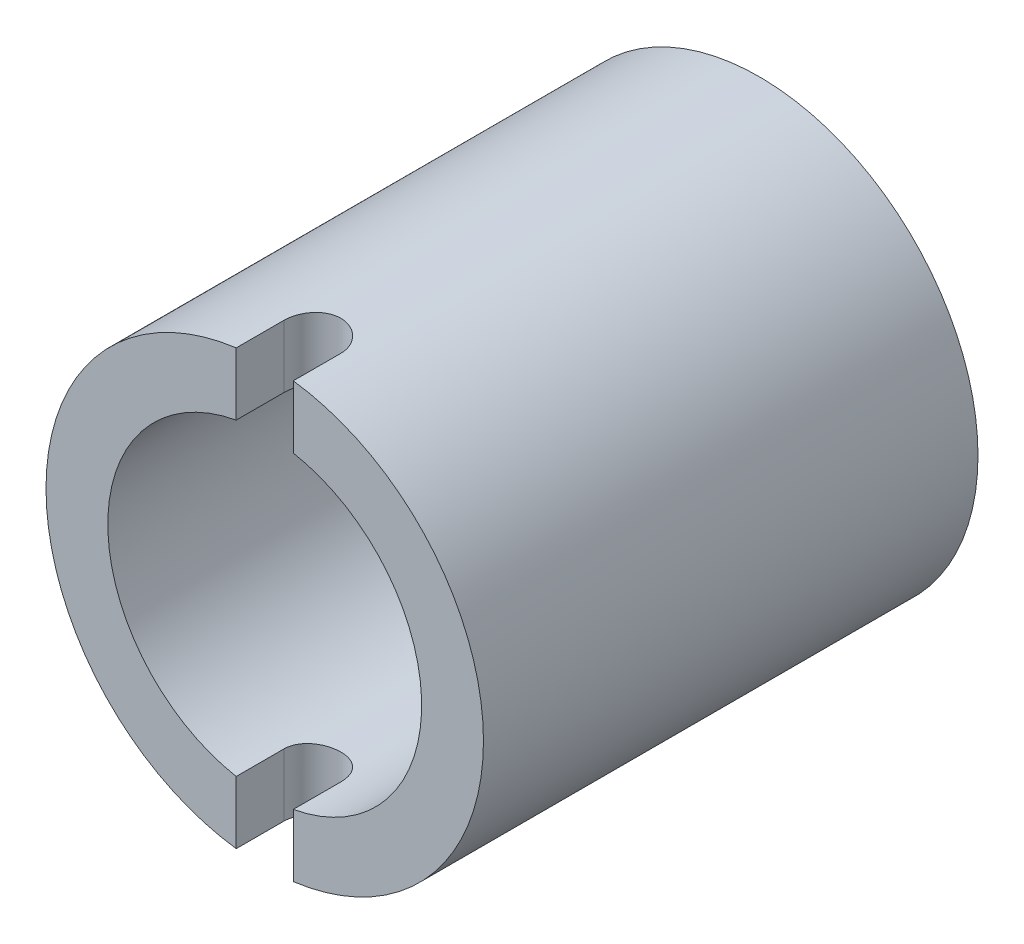
ISO-10303-21;
HEADER;
FILE_DESCRIPTION(('STEP AP214'),'2;1');
FILE_NAME('part.step','',(''),(''),'','','');
FILE_SCHEMA(('AUTOMOTIVE_DESIGN { 1 0 10303 214 1 1 1 1 }'));
ENDSEC;
DATA;
#1=APPLICATION_CONTEXT('core data for automotive mechanical design processes');
#2=APPLICATION_PROTOCOL_DEFINITION('international standard','automotive_design',2000,#1);
#3=PRODUCT_CONTEXT('',#1,'mechanical');
#4=PRODUCT('Part','Part','',(#3));
#5=PRODUCT_RELATED_PRODUCT_CATEGORY('part','',(#4));
#6=PRODUCT_DEFINITION_FORMATION('','',#4);
#7=PRODUCT_DEFINITION_CONTEXT('part definition',#1,'design');
#8=PRODUCT_DEFINITION('design','',#6,#7);
#9=PRODUCT_DEFINITION_SHAPE('','',#8);
#10=(LENGTH_UNIT() NAMED_UNIT(*) SI_UNIT(.MILLI.,.METRE.));
#11=(NAMED_UNIT(*) PLANE_ANGLE_UNIT() SI_UNIT($,.RADIAN.));
#12=(NAMED_UNIT(*) SI_UNIT($,.STERADIAN.) SOLID_ANGLE_UNIT());
#13=UNCERTAINTY_MEASURE_WITH_UNIT(LENGTH_MEASURE(1.E-05),#10,'distance_accuracy_value','');
#14=(GEOMETRIC_REPRESENTATION_CONTEXT(3) GLOBAL_UNCERTAINTY_ASSIGNED_CONTEXT((#13)) GLOBAL_UNIT_ASSIGNED_CONTEXT((#10,
#11,#12)) REPRESENTATION_CONTEXT('',''));
#15=CARTESIAN_POINT('',(0.,0.,0.));
#16=DIRECTION('',(0.,0.,1.));
#17=DIRECTION('',(1.,0.,0.));
#18=AXIS2_PLACEMENT_3D('',#15,#16,#17);
#19=CARTESIAN_POINT('',(0.,0.,20.6375));
#20=DIRECTION('',(0.,0.,1.));
#21=DIRECTION('',(1.,0.,0.));
#22=AXIS2_PLACEMENT_3D('',#19,#20,#21);
#23=PLANE('',#22);
#24=DIRECTION('',(0.,1.,0.));
#25=VECTOR('',#24,1.);
#26=CARTESIAN_POINT('',(-1.190625,-9.128125,20.6375));
#27=LINE('',#26,#25);
#28=CARTESIAN_POINT('',(-1.190625,6.43928923102397,20.6375));
#29=VERTEX_POINT('',#28);
#30=CARTESIAN_POINT('',(-1.190625,9.05014243672441,20.6375));
#31=VERTEX_POINT('',#30);
#32=EDGE_CURVE('E187',#29,#31,#27,.T.);
#33=ORIENTED_EDGE('',*,*,#32,.T.);
#34=CARTESIAN_POINT('',(0.,0.,20.6375));
#35=DIRECTION('',(0.,0.,1.));
#36=DIRECTION('',(1.,0.,0.));
#37=AXIS2_PLACEMENT_3D('',#34,#35,#36);
#38=CIRCLE('',#37,9.128125);
#39=CARTESIAN_POINT('',(-1.190625,-9.05014243672441,20.6375));
#40=VERTEX_POINT('',#39);
#41=EDGE_CURVE('E189',#31,#40,#38,.T.);
#42=ORIENTED_EDGE('',*,*,#41,.T.);
#43=CARTESIAN_POINT('',(-1.190625,-6.43928923102397,20.6375));
#44=VERTEX_POINT('',#43);
#45=EDGE_CURVE('E124',#40,#44,#27,.T.);
#46=ORIENTED_EDGE('',*,*,#45,.T.);
#47=CARTESIAN_POINT('',(0.,0.,20.6375));
#48=DIRECTION('',(0.,0.,1.));
#49=DIRECTION('',(1.,0.,0.));
#50=AXIS2_PLACEMENT_3D('',#47,#48,#49);
#51=CIRCLE('',#50,6.5484375);
#52=EDGE_CURVE('E191',#29,#44,#51,.T.);
#53=ORIENTED_EDGE('',*,*,#52,.F.);
#54=EDGE_LOOP('',(#33,#42,#46,#53));
#55=FACE_BOUND('',#54,.T.);
#56=ADVANCED_FACE('F32',(#55),#23,.T.);
#57=DIRECTION('',(0.,1.,0.));
#58=VECTOR('',#57,1.);
#59=CARTESIAN_POINT('',(1.190625,-9.128125,20.6375));
#60=LINE('',#59,#58);
#61=CARTESIAN_POINT('',(1.190625,-9.0501424367244,20.6375));
#62=VERTEX_POINT('',#61);
#63=CARTESIAN_POINT('',(1.190625,-6.43928923102397,20.6375));
#64=VERTEX_POINT('',#63);
#65=EDGE_CURVE('E56',#62,#64,#60,.T.);
#66=ORIENTED_EDGE('',*,*,#65,.F.);
#67=CARTESIAN_POINT('',(1.190625,9.0501424367244,20.6375));
#68=VERTEX_POINT('',#67);
#69=EDGE_CURVE('E121',#62,#68,#38,.T.);
#70=ORIENTED_EDGE('',*,*,#69,.T.);
#71=CARTESIAN_POINT('',(1.190625,6.43928923102397,20.6375));
#72=VERTEX_POINT('',#71);
#73=EDGE_CURVE('E213',#72,#68,#60,.T.);
#74=ORIENTED_EDGE('',*,*,#73,.F.);
#75=EDGE_CURVE('E206',#64,#72,#51,.T.);
#76=ORIENTED_EDGE('',*,*,#75,.F.);
#77=EDGE_LOOP('',(#66,#70,#74,#76));
#78=FACE_BOUND('',#77,.T.);
#79=ADVANCED_FACE('F168',(#78),#23,.T.);
#80=CARTESIAN_POINT('',(0.,0.,0.));
#81=DIRECTION('',(0.,0.,1.));
#82=DIRECTION('',(1.,0.,0.));
#83=AXIS2_PLACEMENT_3D('',#80,#81,#82);
#84=PLANE('',#83);
#85=CARTESIAN_POINT('',(0.,0.,0.));
#86=DIRECTION('',(0.,0.,1.));
#87=DIRECTION('',(1.,0.,0.));
#88=AXIS2_PLACEMENT_3D('',#85,#86,#87);
#89=CIRCLE('',#88,9.128125);
#90=CARTESIAN_POINT('',(9.128125,0.,0.));
#91=VERTEX_POINT('',#90);
#92=EDGE_CURVE('E200',#91,#91,#89,.T.);
#93=ORIENTED_EDGE('',*,*,#92,.F.);
#94=EDGE_LOOP('',(#93));
#95=FACE_BOUND('',#94,.T.);
#96=CARTESIAN_POINT('',(0.,0.,0.));
#97=DIRECTION('',(0.,0.,1.));
#98=DIRECTION('',(1.,0.,0.));
#99=AXIS2_PLACEMENT_3D('',#96,#97,#98);
#100=CIRCLE('',#99,6.5484375);
#101=CARTESIAN_POINT('',(6.5484375,0.,0.));
#102=VERTEX_POINT('',#101);
#103=EDGE_CURVE('E203',#102,#102,#100,.T.);
#104=ORIENTED_EDGE('',*,*,#103,.T.);
#105=EDGE_LOOP('',(#104));
#106=FACE_BOUND('',#105,.T.);
#107=ADVANCED_FACE('F171',(#95,#106),#84,.F.);
#108=CARTESIAN_POINT('',(0.,0.,20.6375));
#109=DIRECTION('',(0.,0.,-1.));
#110=DIRECTION('',(-1.,0.,0.));
#111=AXIS2_PLACEMENT_3D('',#108,#109,#110);
#112=CYLINDRICAL_SURFACE('',#111,9.128125);
#113=ORIENTED_EDGE('',*,*,#41,.F.);
#114=DIRECTION('',(0.,0.,-1.));
#115=VECTOR('',#114,1.);
#116=CARTESIAN_POINT('',(-1.190625,9.05014243672441,20.6375));
#117=LINE('',#116,#115);
#118=CARTESIAN_POINT('',(-1.190625,9.05014243672441,18.653125));
#119=VERTEX_POINT('',#118);
#120=EDGE_CURVE('E196',#31,#119,#117,.T.);
#121=ORIENTED_EDGE('',*,*,#120,.T.);
#122=CARTESIAN_POINT('',(-1.190625,9.05014243672441,18.653125));
#123=CARTESIAN_POINT('',(-1.190624947356,9.05014137139708,18.6197795693083));
#124=CARTESIAN_POINT('',(-1.18922327600845,9.05032696444553,18.5864502538779));
#125=CARTESIAN_POINT('',(-1.18363255161982,9.05106025548984,18.5200329229892));
#126=CARTESIAN_POINT('',(-1.17944372053075,9.0516079246522,18.4869448885288));
#127=CARTESIAN_POINT('',(-1.16274159058484,9.05377446731096,18.3884759726554));
#128=CARTESIAN_POINT('',(-1.14609251160274,9.05591696148237,18.3237591268127));
#129=CARTESIAN_POINT('',(-1.10224843785137,9.06135731015229,18.1980709970631));
#130=CARTESIAN_POINT('',(-1.07505012176614,9.06465552848673,18.1371008997908));
#131=CARTESIAN_POINT('',(-1.01089108580039,9.07203417337444,18.0205844126923));
#132=CARTESIAN_POINT('',(-0.973931025697229,9.07611454705824,17.9650376566603));
#133=CARTESIAN_POINT('',(-0.89106310246201,9.0846250016956,17.8606217180314));
#134=CARTESIAN_POINT('',(-0.845108557834061,9.08905683209112,17.8117897386654));
#135=CARTESIAN_POINT('',(-0.745650838027167,9.09775565953449,17.7225019923537));
#136=CARTESIAN_POINT('',(-0.692146513891997,9.10202263136735,17.6820475026451));
#137=CARTESIAN_POINT('',(-0.578873843864539,9.10992870060639,17.61053448392));
#138=CARTESIAN_POINT('',(-0.5190837217859,9.11356549142321,17.5795101714068));
#139=CARTESIAN_POINT('',(-0.395090060618663,9.11978171528337,17.5279588349093));
#140=CARTESIAN_POINT('',(-0.330886959898611,9.12236125317347,17.5074307699722));
#141=CARTESIAN_POINT('',(-0.200273515315098,9.12616013279416,17.4775652030612));
#142=CARTESIAN_POINT('',(-0.133877778960786,9.1273871167736,17.4681648046237));
#143=CARTESIAN_POINT('',(-0.000439021817143565,9.12836877170156,17.4606263504033));
#144=CARTESIAN_POINT('',(0.0666039869880744,9.12812346985715,17.462488086502));
#145=CARTESIAN_POINT('',(0.199002437858018,9.12619430511551,17.4773712123961));
#146=CARTESIAN_POINT('',(0.264365665281769,9.12451920317901,17.490324640464));
#147=CARTESIAN_POINT('',(0.391982238971198,9.1199284862309,17.5269170609291));
#148=CARTESIAN_POINT('',(0.454235538957172,9.11701285276474,17.5505562122909));
#149=CARTESIAN_POINT('',(0.574076057119672,9.11025351876185,17.6079212524633));
#150=CARTESIAN_POINT('',(0.631649024051992,9.10640711583797,17.6416765818153));
#151=CARTESIAN_POINT('',(0.740336424381162,9.09821647254577,17.7182929934277));
#152=CARTESIAN_POINT('',(0.791450804378284,9.09387222806186,17.7611541509674));
#153=CARTESIAN_POINT('',(0.886165866514196,9.08513397579924,17.8551390132363));
#154=CARTESIAN_POINT('',(0.929708850347609,9.08073983646005,17.9063208655067));
#155=CARTESIAN_POINT('',(1.00760835898456,9.07242699735334,18.0153159782176));
#156=CARTESIAN_POINT('',(1.04196216777659,9.06850843833791,18.0731311920579));
#157=CARTESIAN_POINT('',(1.10051180372984,9.06158999914031,18.1938128588677));
#158=CARTESIAN_POINT('',(1.12469670995349,9.0585911075694,18.2566846565219));
#159=CARTESIAN_POINT('',(1.16211358774377,9.053867664554,18.38559978733));
#160=CARTESIAN_POINT('',(1.17536203705676,9.05214119639624,18.4516381899777));
#161=CARTESIAN_POINT('',(1.18551629052944,9.05081321998308,18.5406499440119));
#162=CARTESIAN_POINT('',(1.18743295408717,9.05056186000145,18.5631214482745));
#163=CARTESIAN_POINT('',(1.18998559990429,9.05022666112611,18.6081004504055));
#164=CARTESIAN_POINT('',(1.19062373007838,9.0501425412736,18.6306078242253));
#165=CARTESIAN_POINT('',(1.190625,9.05014243672441,18.653125));
#166=B_SPLINE_CURVE_WITH_KNOTS('',3,(#122,#123,#124,#125,#126,#127,#128,#129,#130,#131,#132,
#133,#134,#135,#136,#137,#138,#139,#140,#141,#142,#143,#144,#145,#146,#147,#148,#149,#150,#151,
#152,#153,#154,#155,#156,#157,#158,#159,#160,#161,#162,#163,#164,#165),.UNSPECIFIED.,.F.,.F.,(4,
2,2,2,2,2,2,2,2,2,2,2,2,2,2,2,2,2,2,2,2,4),(0.,0.0999743982543603,0.199940836123429,
0.39948529758251,0.599092634572429,0.798686483940046,0.99934509490912,1.20003427592435,
1.40144317740754,1.60283210052921,1.80307720163999,2.00331860233798,2.20234177944123,
2.40136791738255,2.60097898931192,2.80059171152173,3.00166461323022,3.20279687983,
3.40414460496963,3.60518840684066,3.67282487868008,3.74034762678012),.UNSPECIFIED.);
#167=CARTESIAN_POINT('',(1.190625,9.0501424367244,18.653125));
#168=VERTEX_POINT('',#167);
#169=EDGE_CURVE('E109',#119,#168,#166,.T.);
#170=ORIENTED_EDGE('',*,*,#169,.T.);
#171=DIRECTION('',(0.,0.,-1.));
#172=VECTOR('',#171,1.);
#173=CARTESIAN_POINT('',(1.190625,9.0501424367244,20.6375));
#174=LINE('',#173,#172);
#175=EDGE_CURVE('E122',#168,#68,#174,.F.);
#176=ORIENTED_EDGE('',*,*,#175,.T.);
#177=ORIENTED_EDGE('',*,*,#69,.F.);
#178=DIRECTION('',(0.,0.,-1.));
#179=VECTOR('',#178,1.);
#180=CARTESIAN_POINT('',(1.190625,-9.0501424367244,20.6375));
#181=LINE('',#180,#179);
#182=CARTESIAN_POINT('',(1.190625,-9.0501424367244,18.653125));
#183=VERTEX_POINT('',#182);
#184=EDGE_CURVE('E110',#62,#183,#181,.T.);
#185=ORIENTED_EDGE('',*,*,#184,.T.);
#186=CARTESIAN_POINT('',(1.190625,-9.0501424367244,18.653125));
#187=CARTESIAN_POINT('',(1.190624947356,-9.05014137139708,18.6197795693083));
#188=CARTESIAN_POINT('',(1.18922327600846,-9.05032696444553,18.5864502538779));
#189=CARTESIAN_POINT('',(1.18363255161982,-9.05106025548984,18.5200329229892));
#190=CARTESIAN_POINT('',(1.17944372053075,-9.0516079246522,18.4869448885288));
#191=CARTESIAN_POINT('',(1.16274159058484,-9.05377446731095,18.3884759726554));
#192=CARTESIAN_POINT('',(1.14609251160274,-9.05591696148237,18.3237591268127));
#193=CARTESIAN_POINT('',(1.10224843785138,-9.06135731015229,18.1980709970631));
#194=CARTESIAN_POINT('',(1.07505012176615,-9.06465552848673,18.1371008997908));
#195=CARTESIAN_POINT('',(1.01089108580039,-9.07203417337444,18.0205844126923));
#196=CARTESIAN_POINT('',(0.973931025697232,-9.07611454705824,17.9650376566603));
#197=CARTESIAN_POINT('',(0.891063102462014,-9.0846250016956,17.8606217180314));
#198=CARTESIAN_POINT('',(0.845108557834065,-9.08905683209112,17.8117897386654));
#199=CARTESIAN_POINT('',(0.745650838027171,-9.09775565953449,17.7225019923537));
#200=CARTESIAN_POINT('',(0.692146513892001,-9.10202263136735,17.6820475026451));
#201=CARTESIAN_POINT('',(0.578873843864542,-9.10992870060639,17.61053448392));
#202=CARTESIAN_POINT('',(0.519083721785904,-9.11356549142321,17.5795101714068));
#203=CARTESIAN_POINT('',(0.395090060618666,-9.11978171528337,17.5279588349093));
#204=CARTESIAN_POINT('',(0.330886959898614,-9.12236125317347,17.5074307699722));
#205=CARTESIAN_POINT('',(0.200273515315101,-9.12616013279416,17.4775652030612));
#206=CARTESIAN_POINT('',(0.133877778960789,-9.1273871167736,17.4681648046237));
#207=CARTESIAN_POINT('',(0.000439021817146993,-9.12836877170156,17.4606263504033));
#208=CARTESIAN_POINT('',(-0.066603986988071,-9.12812346985715,17.462488086502));
#209=CARTESIAN_POINT('',(-0.199002437858015,-9.12619430511551,17.4773712123961));
#210=CARTESIAN_POINT('',(-0.264365665281766,-9.12451920317901,17.490324640464));
#211=CARTESIAN_POINT('',(-0.391982238971195,-9.1199284862309,17.5269170609291));
#212=CARTESIAN_POINT('',(-0.454235538957169,-9.11701285276474,17.5505562122909));
#213=CARTESIAN_POINT('',(-0.574076057119668,-9.11025351876185,17.6079212524633));
#214=CARTESIAN_POINT('',(-0.631649024051988,-9.10640711583797,17.6416765818153));
#215=CARTESIAN_POINT('',(-0.740336424381158,-9.09821647254577,17.7182929934277));
#216=CARTESIAN_POINT('',(-0.791450804378281,-9.09387222806186,17.7611541509673));
#217=CARTESIAN_POINT('',(-0.886165866514194,-9.08513397579924,17.8551390132363));
#218=CARTESIAN_POINT('',(-0.929708850347606,-9.08073983646006,17.9063208655067));
#219=CARTESIAN_POINT('',(-1.00760835898456,-9.07242699735334,18.0153159782176));
#220=CARTESIAN_POINT('',(-1.04196216777658,-9.06850843833792,18.0731311920579));
#221=CARTESIAN_POINT('',(-1.10051180372984,-9.06158999914031,18.1938128588677));
#222=CARTESIAN_POINT('',(-1.12469670995349,-9.0585911075694,18.2566846565219));
#223=CARTESIAN_POINT('',(-1.16211358774376,-9.053867664554,18.38559978733));
#224=CARTESIAN_POINT('',(-1.17536203705675,-9.05214119639624,18.4516381899777));
#225=CARTESIAN_POINT('',(-1.18551629052944,-9.05081321998308,18.5406499440119));
#226=CARTESIAN_POINT('',(-1.18743295408717,-9.05056186000145,18.5631214482745));
#227=CARTESIAN_POINT('',(-1.18998559990429,-9.05022666112611,18.6081004504055));
#228=CARTESIAN_POINT('',(-1.19062373007838,-9.0501425412736,18.6306078242253));
#229=CARTESIAN_POINT('',(-1.190625,-9.05014243672441,18.653125));
#230=B_SPLINE_CURVE_WITH_KNOTS('',3,(#186,#187,#188,#189,#190,#191,#192,#193,#194,#195,#196,
#197,#198,#199,#200,#201,#202,#203,#204,#205,#206,#207,#208,#209,#210,#211,#212,#213,#214,#215,
#216,#217,#218,#219,#220,#221,#222,#223,#224,#225,#226,#227,#228,#229),.UNSPECIFIED.,.F.,.F.,(4,
2,2,2,2,2,2,2,2,2,2,2,2,2,2,2,2,2,2,2,2,4),(0.,0.0999743982543638,0.199940836123429,
0.39948529758251,0.599092634572429,0.798686483940046,0.99934509490912,1.20003427592435,
1.40144317740754,1.60283210052921,1.80307720163999,2.00331860233798,2.20234177944123,
2.40136791738255,2.60097898931192,2.80059171152173,3.00166461323022,3.20279687983,
3.40414460496964,3.60518840684066,3.67282487868008,3.74034762678012),.UNSPECIFIED.);
#231=CARTESIAN_POINT('',(-1.190625,-9.05014243672441,18.653125));
#232=VERTEX_POINT('',#231);
#233=EDGE_CURVE('E98',#183,#232,#230,.T.);
#234=ORIENTED_EDGE('',*,*,#233,.T.);
#235=DIRECTION('',(0.,0.,-1.));
#236=VECTOR('',#235,1.);
#237=CARTESIAN_POINT('',(-1.190625,-9.05014243672441,20.6375));
#238=LINE('',#237,#236);
#239=EDGE_CURVE('E197',#232,#40,#238,.F.);
#240=ORIENTED_EDGE('',*,*,#239,.T.);
#241=EDGE_LOOP('',(#113,#121,#170,#176,#177,#185,#234,#240));
#242=FACE_BOUND('',#241,.T.);
#243=ORIENTED_EDGE('',*,*,#92,.T.);
#244=EDGE_LOOP('',(#243));
#245=FACE_BOUND('',#244,.T.);
#246=ADVANCED_FACE('F34',(#242,#245),#112,.T.);
#247=CARTESIAN_POINT('',(0.,0.,20.6375));
#248=DIRECTION('',(0.,0.,-1.));
#249=DIRECTION('',(-1.,0.,0.));
#250=AXIS2_PLACEMENT_3D('',#247,#248,#249);
#251=CYLINDRICAL_SURFACE('',#250,6.5484375);
#252=DIRECTION('',(0.,0.,-1.));
#253=VECTOR('',#252,1.);
#254=CARTESIAN_POINT('',(-1.190625,-6.43928923102397,20.6375));
#255=LINE('',#254,#253);
#256=CARTESIAN_POINT('',(-1.190625,-6.43928923102397,18.653125));
#257=VERTEX_POINT('',#256);
#258=EDGE_CURVE('E11',#257,#44,#255,.F.);
#259=ORIENTED_EDGE('',*,*,#258,.F.);
#260=CARTESIAN_POINT('',(1.190625,-6.43928923102397,18.653125));
#261=CARTESIAN_POINT('',(1.19062510752317,-6.43928770257222,18.6199232680346));
#262=CARTESIAN_POINT('',(1.18923532743987,-6.43954634610227,18.5867377190781));
#263=CARTESIAN_POINT('',(1.18369309264754,-6.44056799660428,18.5206096026158));
#264=CARTESIAN_POINT('',(1.17954094250811,-6.44133094797289,18.4876670087275));
#265=CARTESIAN_POINT('',(1.16299117592537,-6.44434781901215,18.3896568905554));
#266=CARTESIAN_POINT('',(1.146500061898,-6.44732989835494,18.3252546020243));
#267=CARTESIAN_POINT('',(1.10309941994908,-6.45489614735933,18.2001921345008));
#268=CARTESIAN_POINT('',(1.07618809386641,-6.45948059351965,18.1395326034722));
#269=CARTESIAN_POINT('',(1.01272961067242,-6.46973274639033,18.0235750668221));
#270=CARTESIAN_POINT('',(0.976181949820444,-6.47540050972698,17.9682773416965));
#271=CARTESIAN_POINT('',(0.894039305428961,-6.48725382113382,17.8639901260232));
#272=CARTESIAN_POINT('',(0.848354405820006,-6.49344413037186,17.8150720213982));
#273=CARTESIAN_POINT('',(0.749423124613033,-6.50560359349911,17.7255453651157));
#274=CARTESIAN_POINT('',(0.696175581294696,-6.51157271323277,17.6849380924536));
#275=CARTESIAN_POINT('',(0.583162615140336,-6.52266791042578,17.6129181314072));
#276=CARTESIAN_POINT('',(0.523353423398692,-6.52778767299984,17.5815730704674));
#277=CARTESIAN_POINT('',(0.399212828448163,-6.53655334671288,17.5294040367622));
#278=CARTESIAN_POINT('',(0.334882028249734,-6.54019945394524,17.508578664092));
#279=CARTESIAN_POINT('',(0.204267272389198,-6.54557348284042,17.4782597430652));
#280=CARTESIAN_POINT('',(0.138012341535047,-6.54732193006298,17.468644853142));
#281=CARTESIAN_POINT('',(0.00480662729172874,-6.54877433974144,17.4606418941512));
#282=CARTESIAN_POINT('',(-0.0621441163690738,-6.54847841828993,17.4622531875879));
#283=CARTESIAN_POINT('',(-0.194006135992889,-6.5458914545404,17.4765637696531));
#284=CARTESIAN_POINT('',(-0.258932149810519,-6.54362397132675,17.4891321319866));
#285=CARTESIAN_POINT('',(-0.385737614345413,-6.53737506014642,17.524793183831));
#286=CARTESIAN_POINT('',(-0.44761697961102,-6.53339358413657,17.5478861683479));
#287=CARTESIAN_POINT('',(-0.566956566448118,-6.52412438172898,17.6040676099579));
#288=CARTESIAN_POINT('',(-0.624391297389477,-6.51882976168969,17.6372090296749));
#289=CARTESIAN_POINT('',(-0.732931284088821,-6.50752084691352,17.7125065411896));
#290=CARTESIAN_POINT('',(-0.784036154546667,-6.50150650841096,17.7546631813205));
#291=CARTESIAN_POINT('',(-0.879237054342009,-6.48932324144752,17.8475109148418));
#292=CARTESIAN_POINT('',(-0.92322234692524,-6.48315333234577,17.8983154821172));
#293=CARTESIAN_POINT('',(-1.0020758608004,-6.47143510496664,18.0066571101458));
#294=CARTESIAN_POINT('',(-1.03694151929509,-6.46588696166755,18.0641960568312));
#295=CARTESIAN_POINT('',(-1.09659542119064,-6.45603839444269,18.1845229898495));
#296=CARTESIAN_POINT('',(-1.12136250757994,-6.45174059538897,18.2473216673713));
#297=CARTESIAN_POINT('',(-1.15992908896552,-6.44491956903265,18.376242277518));
#298=CARTESIAN_POINT('',(-1.17374494838579,-6.4423936945942,18.4423590940327));
#299=CARTESIAN_POINT('',(-1.18479720692756,-6.44036442329278,18.5330125719995));
#300=CARTESIAN_POINT('',(-1.18698347732095,-6.43996162130896,18.5570023631168));
#301=CARTESIAN_POINT('',(-1.18989550083011,-6.43942427625262,18.6050328913964));
#302=CARTESIAN_POINT('',(-1.19062370760708,-6.43928928251008,18.6290734747022));
#303=CARTESIAN_POINT('',(-1.190625,-6.43928923102397,18.653125));
#304=B_SPLINE_CURVE_WITH_KNOTS('',3,(#260,#261,#262,#263,#264,#265,#266,#267,#268,#269,#270,
#271,#272,#273,#274,#275,#276,#277,#278,#279,#280,#281,#282,#283,#284,#285,#286,#287,#288,#289,
#290,#291,#292,#293,#294,#295,#296,#297,#298,#299,#300,#301,#302,#303),.UNSPECIFIED.,.F.,.F.,(4,
2,2,2,2,2,2,2,2,2,2,2,2,2,2,2,2,2,2,2,2,4),(0.,0.0995431293226911,0.199075285174556,
0.397688211180561,0.596335426058866,0.794993027305768,0.995711320331554,1.19646047970973,
1.39864109789127,1.60079480384762,1.80073947853485,2.00067279915423,2.19824935776925,
2.39583145481025,2.59447361231762,2.79312785528518,2.99462425847635,3.19617722544658,
3.39815031269194,3.59982101947267,3.67206403974184,3.74418538536144),.UNSPECIFIED.);
#305=CARTESIAN_POINT('',(1.190625,-6.43928923102397,18.653125));
#306=VERTEX_POINT('',#305);
#307=EDGE_CURVE('E41',#306,#257,#304,.T.);
#308=ORIENTED_EDGE('',*,*,#307,.F.);
#309=DIRECTION('',(0.,0.,-1.));
#310=VECTOR('',#309,1.);
#311=CARTESIAN_POINT('',(1.190625,-6.43928923102397,20.6375));
#312=LINE('',#311,#310);
#313=EDGE_CURVE('E113',#64,#306,#312,.T.);
#314=ORIENTED_EDGE('',*,*,#313,.F.);
#315=ORIENTED_EDGE('',*,*,#75,.T.);
#316=DIRECTION('',(0.,0.,-1.));
#317=VECTOR('',#316,1.);
#318=CARTESIAN_POINT('',(1.190625,6.43928923102397,20.6375));
#319=LINE('',#318,#317);
#320=CARTESIAN_POINT('',(1.190625,6.43928923102397,18.653125));
#321=VERTEX_POINT('',#320);
#322=EDGE_CURVE('E198',#321,#72,#319,.F.);
#323=ORIENTED_EDGE('',*,*,#322,.F.);
#324=CARTESIAN_POINT('',(-1.190625,6.43928923102397,18.653125));
#325=CARTESIAN_POINT('',(-1.19062510752316,6.43928770257222,18.6199232680346));
#326=CARTESIAN_POINT('',(-1.18923532743986,6.43954634610227,18.5867377190781));
#327=CARTESIAN_POINT('',(-1.18369309264754,6.44056799660428,18.5206096026158));
#328=CARTESIAN_POINT('',(-1.17954094250811,6.44133094797289,18.4876670087275));
#329=CARTESIAN_POINT('',(-1.16299117592536,6.44434781901215,18.3896568905554));
#330=CARTESIAN_POINT('',(-1.146500061898,6.44732989835494,18.3252546020243));
#331=CARTESIAN_POINT('',(-1.10309941994908,6.45489614735933,18.2001921345008));
#332=CARTESIAN_POINT('',(-1.07618809386641,6.45948059351965,18.1395326034722));
#333=CARTESIAN_POINT('',(-1.01272961067242,6.46973274639033,18.0235750668221));
#334=CARTESIAN_POINT('',(-0.976181949820441,6.47540050972698,17.9682773416965));
#335=CARTESIAN_POINT('',(-0.894039305428957,6.48725382113382,17.8639901260232));
#336=CARTESIAN_POINT('',(-0.848354405820003,6.49344413037186,17.8150720213982));
#337=CARTESIAN_POINT('',(-0.749423124613029,6.50560359349911,17.7255453651157));
#338=CARTESIAN_POINT('',(-0.696175581294693,6.51157271323277,17.6849380924536));
#339=CARTESIAN_POINT('',(-0.583162615140332,6.52266791042578,17.6129181314072));
#340=CARTESIAN_POINT('',(-0.523353423398689,6.52778767299984,17.5815730704674));
#341=CARTESIAN_POINT('',(-0.39921282844816,6.53655334671288,17.5294040367622));
#342=CARTESIAN_POINT('',(-0.33488202824973,6.54019945394524,17.508578664092));
#343=CARTESIAN_POINT('',(-0.204267272389195,6.54557348284042,17.4782597430652));
#344=CARTESIAN_POINT('',(-0.138012341535044,6.54732193006298,17.468644853142));
#345=CARTESIAN_POINT('',(-0.00480662729172546,6.54877433974144,17.4606418941512));
#346=CARTESIAN_POINT('',(0.0621441163690771,6.54847841828993,17.4622531875879));
#347=CARTESIAN_POINT('',(0.194006135992892,6.5458914545404,17.4765637696531));
#348=CARTESIAN_POINT('',(0.258932149810522,6.54362397132675,17.4891321319866));
#349=CARTESIAN_POINT('',(0.385737614345415,6.53737506014642,17.524793183831));
#350=CARTESIAN_POINT('',(0.447616979611023,6.53339358413657,17.5478861683479));
#351=CARTESIAN_POINT('',(0.566956566448122,6.52412438172898,17.6040676099579));
#352=CARTESIAN_POINT('',(0.62439129738948,6.51882976168969,17.6372090296749));
#353=CARTESIAN_POINT('',(0.732931284088825,6.50752084691352,17.7125065411896));
#354=CARTESIAN_POINT('',(0.784036154546671,6.50150650841096,17.7546631813205));
#355=CARTESIAN_POINT('',(0.879237054342012,6.48932324144752,17.8475109148418));
#356=CARTESIAN_POINT('',(0.923222346925243,6.48315333234577,17.8983154821172));
#357=CARTESIAN_POINT('',(1.00207586080041,6.47143510496664,18.0066571101458));
#358=CARTESIAN_POINT('',(1.0369415192951,6.46588696166755,18.0641960568312));
#359=CARTESIAN_POINT('',(1.09659542119064,6.45603839444269,18.1845229898495));
#360=CARTESIAN_POINT('',(1.12136250757994,6.45174059538897,18.2473216673713));
#361=CARTESIAN_POINT('',(1.15992908896553,6.44491956903265,18.376242277518));
#362=CARTESIAN_POINT('',(1.17374494838579,6.4423936945942,18.4423590940327));
#363=CARTESIAN_POINT('',(1.18479720692757,6.44036442329278,18.5330125719995));
#364=CARTESIAN_POINT('',(1.18698347732096,6.43996162130896,18.5570023631168));
#365=CARTESIAN_POINT('',(1.18989550083011,6.43942427625262,18.6050328913964));
#366=CARTESIAN_POINT('',(1.19062370760709,6.43928928251007,18.6290734747022));
#367=CARTESIAN_POINT('',(1.190625,6.43928923102397,18.653125));
#368=B_SPLINE_CURVE_WITH_KNOTS('',3,(#324,#325,#326,#327,#328,#329,#330,#331,#332,#333,#334,
#335,#336,#337,#338,#339,#340,#341,#342,#343,#344,#345,#346,#347,#348,#349,#350,#351,#352,#353,
#354,#355,#356,#357,#358,#359,#360,#361,#362,#363,#364,#365,#366,#367),.UNSPECIFIED.,.F.,.F.,(4,
2,2,2,2,2,2,2,2,2,2,2,2,2,2,2,2,2,2,2,2,4),(0.,0.0995431293226911,0.199075285174556,
0.397688211180561,0.596335426058862,0.794993027305768,0.995711320331554,1.19646047970973,
1.39864109789127,1.60079480384762,1.80073947853485,2.00067279915423,2.19824935776925,
2.39583145481025,2.59447361231762,2.79312785528518,2.99462425847635,3.19617722544658,
3.39815031269194,3.59982101947267,3.67206403974184,3.74418538536145),.UNSPECIFIED.);
#369=CARTESIAN_POINT('',(-1.190625,6.43928923102397,18.653125));
#370=VERTEX_POINT('',#369);
#371=EDGE_CURVE('E150',#370,#321,#368,.T.);
#372=ORIENTED_EDGE('',*,*,#371,.F.);
#373=DIRECTION('',(0.,0.,-1.));
#374=VECTOR('',#373,1.);
#375=CARTESIAN_POINT('',(-1.190625,6.43928923102397,20.6375));
#376=LINE('',#375,#374);
#377=EDGE_CURVE('E221',#29,#370,#376,.T.);
#378=ORIENTED_EDGE('',*,*,#377,.F.);
#379=ORIENTED_EDGE('',*,*,#52,.T.);
#380=EDGE_LOOP('',(#259,#308,#314,#315,#323,#372,#378,#379));
#381=FACE_BOUND('',#380,.T.);
#382=ORIENTED_EDGE('',*,*,#103,.F.);
#383=EDGE_LOOP('',(#382));
#384=FACE_BOUND('',#383,.T.);
#385=ADVANCED_FACE('F163',(#381,#384),#251,.F.);
#386=CARTESIAN_POINT('',(1.190625,-9.128125,18.653125));
#387=DIRECTION('',(1.,0.,0.));
#388=DIRECTION('',(0.,0.,-1.));
#389=AXIS2_PLACEMENT_3D('',#386,#387,#388);
#390=PLANE('',#389);
#391=DIRECTION('',(0.,1.,0.));
#392=VECTOR('',#391,1.);
#393=CARTESIAN_POINT('',(1.190625,-9.128125,18.653125));
#394=LINE('',#393,#392);
#395=EDGE_CURVE('E48',#321,#168,#394,.T.);
#396=ORIENTED_EDGE('',*,*,#395,.F.);
#397=ORIENTED_EDGE('',*,*,#322,.T.);
#398=ORIENTED_EDGE('',*,*,#73,.T.);
#399=ORIENTED_EDGE('',*,*,#175,.F.);
#400=EDGE_LOOP('',(#396,#397,#398,#399));
#401=FACE_BOUND('',#400,.T.);
#402=ADVANCED_FACE('F144',(#401),#390,.F.);
#403=CARTESIAN_POINT('',(0.,-9.128125,18.653125));
#404=DIRECTION('',(0.,1.,0.));
#405=DIRECTION('',(0.,0.,1.));
#406=AXIS2_PLACEMENT_3D('',#403,#404,#405);
#407=CYLINDRICAL_SURFACE('',#406,1.190625);
#408=DIRECTION('',(0.,1.,0.));
#409=VECTOR('',#408,1.);
#410=CARTESIAN_POINT('',(-1.190625,-9.128125,18.653125));
#411=LINE('',#410,#409);
#412=EDGE_CURVE('E114',#370,#119,#411,.T.);
#413=ORIENTED_EDGE('',*,*,#412,.F.);
#414=ORIENTED_EDGE('',*,*,#371,.T.);
#415=ORIENTED_EDGE('',*,*,#395,.T.);
#416=ORIENTED_EDGE('',*,*,#169,.F.);
#417=EDGE_LOOP('',(#413,#414,#415,#416));
#418=FACE_BOUND('',#417,.T.);
#419=ADVANCED_FACE('F138',(#418),#407,.F.);
#420=CARTESIAN_POINT('',(-1.190625,-9.128125,20.6375));
#421=DIRECTION('',(-1.,0.,0.));
#422=DIRECTION('',(0.,0.,1.));
#423=AXIS2_PLACEMENT_3D('',#420,#421,#422);
#424=PLANE('',#423);
#425=ORIENTED_EDGE('',*,*,#32,.F.);
#426=ORIENTED_EDGE('',*,*,#377,.T.);
#427=ORIENTED_EDGE('',*,*,#412,.T.);
#428=ORIENTED_EDGE('',*,*,#120,.F.);
#429=EDGE_LOOP('',(#425,#426,#427,#428));
#430=FACE_BOUND('',#429,.T.);
#431=ADVANCED_FACE('F143',(#430),#424,.F.);
#432=EDGE_CURVE('E104',#232,#257,#411,.T.);
#433=ORIENTED_EDGE('',*,*,#432,.T.);
#434=ORIENTED_EDGE('',*,*,#258,.T.);
#435=ORIENTED_EDGE('',*,*,#45,.F.);
#436=ORIENTED_EDGE('',*,*,#239,.F.);
#437=EDGE_LOOP('',(#433,#434,#435,#436));
#438=FACE_BOUND('',#437,.T.);
#439=ADVANCED_FACE('F218',(#438),#424,.F.);
#440=EDGE_CURVE('E101',#183,#306,#394,.T.);
#441=ORIENTED_EDGE('',*,*,#440,.T.);
#442=ORIENTED_EDGE('',*,*,#307,.T.);
#443=ORIENTED_EDGE('',*,*,#432,.F.);
#444=ORIENTED_EDGE('',*,*,#233,.F.);
#445=EDGE_LOOP('',(#441,#442,#443,#444));
#446=FACE_BOUND('',#445,.T.);
#447=ADVANCED_FACE('F100',(#446),#407,.F.);
#448=ORIENTED_EDGE('',*,*,#65,.T.);
#449=ORIENTED_EDGE('',*,*,#313,.T.);
#450=ORIENTED_EDGE('',*,*,#440,.F.);
#451=ORIENTED_EDGE('',*,*,#184,.F.);
#452=EDGE_LOOP('',(#448,#449,#450,#451));
#453=FACE_BOUND('',#452,.T.);
#454=ADVANCED_FACE('F112',(#453),#390,.F.);
#455=CLOSED_SHELL('',(#56,#79,#107,#246,#385,#402,#419,#431,#439,#447,#454));
#456=MANIFOLD_SOLID_BREP('B2',#455);
#457=ADVANCED_BREP_SHAPE_REPRESENTATION('',(#18,#456),#14);
#458=SHAPE_DEFINITION_REPRESENTATION(#9,#457);
ENDSEC;
END-ISO-10303-21;
